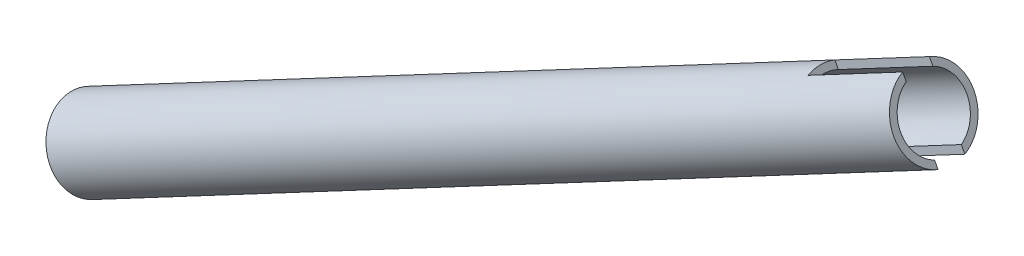
ISO-10303-21;
HEADER;
FILE_DESCRIPTION(('STEP AP214'),'2;1');
FILE_NAME('part.step','',(''),(''),'','','');
FILE_SCHEMA(('AUTOMOTIVE_DESIGN { 1 0 10303 214 1 1 1 1 }'));
ENDSEC;
DATA;
#1=APPLICATION_CONTEXT('core data for automotive mechanical design processes');
#2=APPLICATION_PROTOCOL_DEFINITION('international standard','automotive_design',2000,#1);
#3=PRODUCT_CONTEXT('',#1,'mechanical');
#4=PRODUCT('Part','Part','',(#3));
#5=PRODUCT_RELATED_PRODUCT_CATEGORY('part','',(#4));
#6=PRODUCT_DEFINITION_FORMATION('','',#4);
#7=PRODUCT_DEFINITION_CONTEXT('part definition',#1,'design');
#8=PRODUCT_DEFINITION('design','',#6,#7);
#9=PRODUCT_DEFINITION_SHAPE('','',#8);
#10=(LENGTH_UNIT() NAMED_UNIT(*) SI_UNIT(.MILLI.,.METRE.));
#11=(NAMED_UNIT(*) PLANE_ANGLE_UNIT() SI_UNIT($,.RADIAN.));
#12=(NAMED_UNIT(*) SI_UNIT($,.STERADIAN.) SOLID_ANGLE_UNIT());
#13=UNCERTAINTY_MEASURE_WITH_UNIT(LENGTH_MEASURE(1.E-05),#10,'distance_accuracy_value','');
#14=(GEOMETRIC_REPRESENTATION_CONTEXT(3) GLOBAL_UNCERTAINTY_ASSIGNED_CONTEXT((#13)) GLOBAL_UNIT_ASSIGNED_CONTEXT((#10,
#11,#12)) REPRESENTATION_CONTEXT('',''));
#15=CARTESIAN_POINT('',(0.,0.,0.));
#16=DIRECTION('',(0.,0.,1.));
#17=DIRECTION('',(1.,0.,0.));
#18=AXIS2_PLACEMENT_3D('',#15,#16,#17);
#19=CARTESIAN_POINT('',(576.014178168981,-30.0521994710777,0.));
#20=DIRECTION('',(0.883358506158831,0.468697930011258,0.));
#21=DIRECTION('',(-0.468697930011258,0.883358506158831,0.));
#22=AXIS2_PLACEMENT_3D('',#19,#20,#21);
#23=PLANE('',#22);
#24=CARTESIAN_POINT('',(572.323650668072,-23.0966345935831,0.));
#25=DIRECTION('',(-0.883358506158831,-0.468697930011258,0.));
#26=DIRECTION('',(0.468697930011258,-0.883358506158831,0.));
#27=AXIS2_PLACEMENT_3D('',#24,#25,#26);
#28=CIRCLE('',#27,9.52500000000005);
#29=CARTESIAN_POINT('',(568.114623213156,-15.1638489615516,-3.175));
#30=VERTEX_POINT('',#29);
#31=CARTESIAN_POINT('',(576.532678122988,-31.0294202256146,-3.175));
#32=VERTEX_POINT('',#31);
#33=EDGE_CURVE('E111',#30,#32,#28,.T.);
#34=ORIENTED_EDGE('',*,*,#33,.F.);
#35=DIRECTION('',(0.46869793001126,-0.88335850615883,0.));
#36=VECTOR('',#35,1.);
#37=CARTESIAN_POINT('',(576.787998451429,-31.5106243647461,-3.175));
#38=LINE('',#37,#36);
#39=CARTESIAN_POINT('',(568.946447058511,-16.7315936055324,-3.175));
#40=VERTEX_POINT('',#39);
#41=EDGE_CURVE('E55',#30,#40,#38,.T.);
#42=ORIENTED_EDGE('',*,*,#41,.T.);
#43=CARTESIAN_POINT('',(572.323650668072,-23.0966345935831,0.));
#44=DIRECTION('',(-0.883358506158831,-0.468697930011258,0.));
#45=DIRECTION('',(0.468697930011258,-0.883358506158831,0.));
#46=AXIS2_PLACEMENT_3D('',#43,#44,#45);
#47=CIRCLE('',#46,7.87399999999994);
#48=CARTESIAN_POINT('',(575.700854277633,-29.4616755816338,-3.175));
#49=VERTEX_POINT('',#48);
#50=EDGE_CURVE('E109',#40,#49,#47,.T.);
#51=ORIENTED_EDGE('',*,*,#50,.T.);
#52=EDGE_CURVE('E112',#49,#32,#38,.T.);
#53=ORIENTED_EDGE('',*,*,#52,.T.);
#54=EDGE_LOOP('',(#34,#42,#51,#53));
#55=FACE_BOUND('',#54,.T.);
#56=ADVANCED_FACE('F32',(#55),#23,.T.);
#57=CARTESIAN_POINT('',(553.143743582989,-33.273230716121,0.));
#58=DIRECTION('',(-0.883358506158831,-0.468697930011258,0.));
#59=DIRECTION('',(0.468697930011258,-0.883358506158831,0.));
#60=AXIS2_PLACEMENT_3D('',#57,#58,#59);
#61=CYLINDRICAL_SURFACE('',#60,9.52500000000017);
#62=CARTESIAN_POINT('',(372.096907979902,-129.33420311932,0.));
#63=DIRECTION('',(-0.883358506158831,-0.468697930011258,0.));
#64=DIRECTION('',(0.468697930011258,-0.883358506158831,0.));
#65=AXIS2_PLACEMENT_3D('',#62,#63,#64);
#66=CIRCLE('',#65,9.5250000000003);
#67=CARTESIAN_POINT('',(376.56125576326,-137.748192890484,0.));
#68=VERTEX_POINT('',#67);
#69=EDGE_CURVE('E167',#68,#68,#66,.T.);
#70=ORIENTED_EDGE('',*,*,#69,.F.);
#71=EDGE_LOOP('',(#70));
#72=FACE_BOUND('',#71,.T.);
#73=DIRECTION('',(-0.883358506158831,-0.468697930011258,0.));
#74=VECTOR('',#73,1.);
#75=CARTESIAN_POINT('',(548.934716128073,-25.3404450840894,3.175));
#76=LINE('',#75,#74);
#77=CARTESIAN_POINT('',(545.677317156722,-27.0687763838375,3.175));
#78=VERTEX_POINT('',#77);
#79=CARTESIAN_POINT('',(568.114623213156,-15.1638489615516,3.175));
#80=VERTEX_POINT('',#79);
#81=EDGE_CURVE('E11',#78,#80,#76,.F.);
#82=ORIENTED_EDGE('',*,*,#81,.F.);
#83=CARTESIAN_POINT('',(549.886344611638,-35.001562015869,0.));
#84=DIRECTION('',(0.883358506158832,0.468697930011256,0.));
#85=DIRECTION('',(-0.468697930011256,0.883358506158832,0.));
#86=AXIS2_PLACEMENT_3D('',#83,#84,#85);
#87=CIRCLE('',#86,9.52500000000017);
#88=CARTESIAN_POINT('',(545.677317156722,-27.0687763838375,-3.175));
#89=VERTEX_POINT('',#88);
#90=EDGE_CURVE('E136',#78,#89,#87,.F.);
#91=ORIENTED_EDGE('',*,*,#90,.T.);
#92=DIRECTION('',(-0.883358506158831,-0.468697930011258,0.));
#93=VECTOR('',#92,1.);
#94=CARTESIAN_POINT('',(548.934716128073,-25.3404450840894,-3.175));
#95=LINE('',#94,#93);
#96=EDGE_CURVE('E135',#89,#30,#95,.F.);
#97=ORIENTED_EDGE('',*,*,#96,.T.);
#98=ORIENTED_EDGE('',*,*,#33,.T.);
#99=DIRECTION('',(-0.883358506158831,-0.468697930011258,0.));
#100=VECTOR('',#99,1.);
#101=CARTESIAN_POINT('',(557.352771037905,-41.2060163481525,-3.175));
#102=LINE('',#101,#100);
#103=CARTESIAN_POINT('',(554.095372066554,-42.9343476479005,-3.175));
#104=VERTEX_POINT('',#103);
#105=EDGE_CURVE('E130',#32,#104,#102,.T.);
#106=ORIENTED_EDGE('',*,*,#105,.T.);
#107=CARTESIAN_POINT('',(554.095372066554,-42.9343476479005,3.175));
#108=VERTEX_POINT('',#107);
#109=EDGE_CURVE('E133',#104,#108,#87,.F.);
#110=ORIENTED_EDGE('',*,*,#109,.T.);
#111=DIRECTION('',(-0.883358506158831,-0.468697930011258,0.));
#112=VECTOR('',#111,1.);
#113=CARTESIAN_POINT('',(557.352771037905,-41.2060163481525,3.175));
#114=LINE('',#113,#112);
#115=CARTESIAN_POINT('',(576.532678122988,-31.0294202256146,3.175));
#116=VERTEX_POINT('',#115);
#117=EDGE_CURVE('E40',#116,#108,#114,.T.);
#118=ORIENTED_EDGE('',*,*,#117,.F.);
#119=EDGE_CURVE('E120',#116,#80,#28,.T.);
#120=ORIENTED_EDGE('',*,*,#119,.T.);
#121=EDGE_LOOP('',(#82,#91,#97,#98,#106,#110,#118,#120));
#122=FACE_BOUND('',#121,.T.);
#123=ADVANCED_FACE('F145',(#72,#122),#61,.T.);
#124=CARTESIAN_POINT('',(376.56125576326,-137.748192890484,0.));
#125=DIRECTION('',(-0.883358506158831,-0.468697930011258,0.));
#126=DIRECTION('',(0.468697930011258,-0.883358506158831,0.));
#127=AXIS2_PLACEMENT_3D('',#124,#125,#126);
#128=PLANE('',#127);
#129=ORIENTED_EDGE('',*,*,#69,.T.);
#130=EDGE_LOOP('',(#129));
#131=FACE_BOUND('',#130,.T.);
#132=CARTESIAN_POINT('',(372.096907979902,-129.33420311932,0.));
#133=DIRECTION('',(-0.883358506158831,-0.468697930011258,0.));
#134=DIRECTION('',(0.468697930011258,-0.883358506158831,0.));
#135=AXIS2_PLACEMENT_3D('',#132,#133,#134);
#136=CIRCLE('',#135,7.87400000000023);
#137=CARTESIAN_POINT('',(375.787435480811,-136.289767996815,0.));
#138=VERTEX_POINT('',#137);
#139=EDGE_CURVE('E123',#138,#138,#136,.T.);
#140=ORIENTED_EDGE('',*,*,#139,.F.);
#141=EDGE_LOOP('',(#140));
#142=FACE_BOUND('',#141,.T.);
#143=ADVANCED_FACE('F34',(#131,#142),#128,.T.);
#144=CARTESIAN_POINT('',(553.143743582989,-33.273230716121,0.));
#145=DIRECTION('',(-0.883358506158831,-0.468697930011258,0.));
#146=DIRECTION('',(0.468697930011258,-0.883358506158831,0.));
#147=AXIS2_PLACEMENT_3D('',#144,#145,#146);
#148=CYLINDRICAL_SURFACE('',#147,7.87400000000007);
#149=DIRECTION('',(-0.883358506158831,-0.468697930011258,0.));
#150=VECTOR('',#149,1.);
#151=CARTESIAN_POINT('',(549.766539973427,-26.9081897280701,3.175));
#152=LINE('',#151,#150);
#153=CARTESIAN_POINT('',(568.946447058511,-16.7315936055324,3.175));
#154=VERTEX_POINT('',#153);
#155=CARTESIAN_POINT('',(546.509141002076,-28.6365210278181,3.175));
#156=VERTEX_POINT('',#155);
#157=EDGE_CURVE('E154',#154,#156,#152,.T.);
#158=ORIENTED_EDGE('',*,*,#157,.F.);
#159=CARTESIAN_POINT('',(575.700854277633,-29.4616755816338,3.175));
#160=VERTEX_POINT('',#159);
#161=EDGE_CURVE('E119',#160,#154,#47,.T.);
#162=ORIENTED_EDGE('',*,*,#161,.F.);
#163=DIRECTION('',(-0.883358506158831,-0.468697930011258,0.));
#164=VECTOR('',#163,1.);
#165=CARTESIAN_POINT('',(556.52094719255,-39.6382717041718,3.175));
#166=LINE('',#165,#164);
#167=CARTESIAN_POINT('',(553.263548221199,-41.3666030039199,3.175));
#168=VERTEX_POINT('',#167);
#169=EDGE_CURVE('E102',#168,#160,#166,.F.);
#170=ORIENTED_EDGE('',*,*,#169,.F.);
#171=CARTESIAN_POINT('',(549.886344611638,-35.001562015869,0.));
#172=DIRECTION('',(0.883358506158832,0.468697930011256,0.));
#173=DIRECTION('',(-0.468697930011256,0.883358506158832,0.));
#174=AXIS2_PLACEMENT_3D('',#171,#172,#173);
#175=CIRCLE('',#174,7.87400000000007);
#176=CARTESIAN_POINT('',(553.263548221199,-41.3666030039199,-3.175));
#177=VERTEX_POINT('',#176);
#178=EDGE_CURVE('E166',#168,#177,#175,.T.);
#179=ORIENTED_EDGE('',*,*,#178,.T.);
#180=DIRECTION('',(-0.883358506158831,-0.468697930011258,0.));
#181=VECTOR('',#180,1.);
#182=CARTESIAN_POINT('',(556.52094719255,-39.6382717041718,-3.175));
#183=LINE('',#182,#181);
#184=EDGE_CURVE('E103',#177,#49,#183,.F.);
#185=ORIENTED_EDGE('',*,*,#184,.T.);
#186=ORIENTED_EDGE('',*,*,#50,.F.);
#187=DIRECTION('',(-0.883358506158831,-0.468697930011258,0.));
#188=VECTOR('',#187,1.);
#189=CARTESIAN_POINT('',(549.766539973427,-26.9081897280701,-3.175));
#190=LINE('',#189,#188);
#191=CARTESIAN_POINT('',(546.509141002076,-28.6365210278181,-3.175));
#192=VERTEX_POINT('',#191);
#193=EDGE_CURVE('E95',#40,#192,#190,.T.);
#194=ORIENTED_EDGE('',*,*,#193,.T.);
#195=EDGE_CURVE('E165',#192,#156,#175,.T.);
#196=ORIENTED_EDGE('',*,*,#195,.T.);
#197=EDGE_LOOP('',(#158,#162,#170,#179,#185,#186,#194,#196));
#198=FACE_BOUND('',#197,.T.);
#199=ORIENTED_EDGE('',*,*,#139,.T.);
#200=EDGE_LOOP('',(#199));
#201=FACE_BOUND('',#200,.T.);
#202=ADVANCED_FACE('F116',(#198,#201),#148,.F.);
#203=DIRECTION('',(-0.46869793001126,0.88335850615883,0.));
#204=VECTOR('',#203,1.);
#205=CARTESIAN_POINT('',(576.787998451429,-31.5106243647461,3.175));
#206=LINE('',#205,#204);
#207=EDGE_CURVE('E161',#154,#80,#206,.T.);
#208=ORIENTED_EDGE('',*,*,#207,.T.);
#209=ORIENTED_EDGE('',*,*,#119,.F.);
#210=EDGE_CURVE('E158',#116,#160,#206,.T.);
#211=ORIENTED_EDGE('',*,*,#210,.T.);
#212=ORIENTED_EDGE('',*,*,#161,.T.);
#213=EDGE_LOOP('',(#208,#209,#211,#212));
#214=FACE_BOUND('',#213,.T.);
#215=ADVANCED_FACE('F179',(#214),#23,.T.);
#216=CARTESIAN_POINT('',(0.,0.,-3.175));
#217=DIRECTION('',(0.,0.,1.));
#218=DIRECTION('',(1.,0.,0.));
#219=AXIS2_PLACEMENT_3D('',#216,#217,#218);
#220=PLANE('',#219);
#221=DIRECTION('',(-0.468697930011256,0.883358506158832,0.));
#222=VECTOR('',#221,1.);
#223=CARTESIAN_POINT('',(545.42199682828,-26.587572244706,-3.175));
#224=LINE('',#223,#222);
#225=EDGE_CURVE('E47',#104,#177,#224,.T.);
#226=ORIENTED_EDGE('',*,*,#225,.F.);
#227=ORIENTED_EDGE('',*,*,#105,.F.);
#228=ORIENTED_EDGE('',*,*,#52,.F.);
#229=ORIENTED_EDGE('',*,*,#184,.F.);
#230=EDGE_LOOP('',(#226,#227,#228,#229));
#231=FACE_BOUND('',#230,.T.);
#232=ADVANCED_FACE('F180',(#231),#220,.T.);
#233=CARTESIAN_POINT('',(0.,0.,3.175));
#234=DIRECTION('',(0.,0.,1.));
#235=DIRECTION('',(1.,0.,0.));
#236=AXIS2_PLACEMENT_3D('',#233,#234,#235);
#237=PLANE('',#236);
#238=ORIENTED_EDGE('',*,*,#169,.T.);
#239=ORIENTED_EDGE('',*,*,#210,.F.);
#240=ORIENTED_EDGE('',*,*,#117,.T.);
#241=DIRECTION('',(0.468697930011256,-0.883358506158832,0.));
#242=VECTOR('',#241,1.);
#243=CARTESIAN_POINT('',(545.42199682828,-26.587572244706,3.175));
#244=LINE('',#243,#242);
#245=EDGE_CURVE('E155',#168,#108,#244,.T.);
#246=ORIENTED_EDGE('',*,*,#245,.F.);
#247=EDGE_LOOP('',(#238,#239,#240,#246));
#248=FACE_BOUND('',#247,.T.);
#249=ADVANCED_FACE('F175',(#248),#237,.F.);
#250=CARTESIAN_POINT('',(545.42199682828,-26.587572244706,45.7121132125869));
#251=DIRECTION('',(0.883358506158832,0.468697930011256,0.));
#252=DIRECTION('',(-0.468697930011256,0.883358506158832,0.));
#253=AXIS2_PLACEMENT_3D('',#250,#251,#252);
#254=PLANE('',#253);
#255=ORIENTED_EDGE('',*,*,#245,.T.);
#256=ORIENTED_EDGE('',*,*,#109,.F.);
#257=ORIENTED_EDGE('',*,*,#225,.T.);
#258=ORIENTED_EDGE('',*,*,#178,.F.);
#259=EDGE_LOOP('',(#255,#256,#257,#258));
#260=FACE_BOUND('',#259,.T.);
#261=ADVANCED_FACE('F174',(#260),#254,.T.);
#262=ORIENTED_EDGE('',*,*,#157,.T.);
#263=EDGE_CURVE('E150',#78,#156,#244,.T.);
#264=ORIENTED_EDGE('',*,*,#263,.F.);
#265=ORIENTED_EDGE('',*,*,#81,.T.);
#266=ORIENTED_EDGE('',*,*,#207,.F.);
#267=EDGE_LOOP('',(#262,#264,#265,#266));
#268=FACE_BOUND('',#267,.T.);
#269=ADVANCED_FACE('F152',(#268),#237,.F.);
#270=ORIENTED_EDGE('',*,*,#41,.F.);
#271=ORIENTED_EDGE('',*,*,#96,.F.);
#272=EDGE_CURVE('E98',#192,#89,#224,.T.);
#273=ORIENTED_EDGE('',*,*,#272,.F.);
#274=ORIENTED_EDGE('',*,*,#193,.F.);
#275=EDGE_LOOP('',(#270,#271,#273,#274));
#276=FACE_BOUND('',#275,.T.);
#277=ADVANCED_FACE('F96',(#276),#220,.T.);
#278=ORIENTED_EDGE('',*,*,#272,.T.);
#279=ORIENTED_EDGE('',*,*,#90,.F.);
#280=ORIENTED_EDGE('',*,*,#263,.T.);
#281=ORIENTED_EDGE('',*,*,#195,.F.);
#282=EDGE_LOOP('',(#278,#279,#280,#281));
#283=FACE_BOUND('',#282,.T.);
#284=ADVANCED_FACE('F149',(#283),#254,.T.);
#285=CLOSED_SHELL('',(#56,#123,#143,#202,#215,#232,#249,#261,#269,#277,#284));
#286=MANIFOLD_SOLID_BREP('B2',#285);
#287=ADVANCED_BREP_SHAPE_REPRESENTATION('',(#18,#286),#14);
#288=SHAPE_DEFINITION_REPRESENTATION(#9,#287);
ENDSEC;
END-ISO-10303-21;
